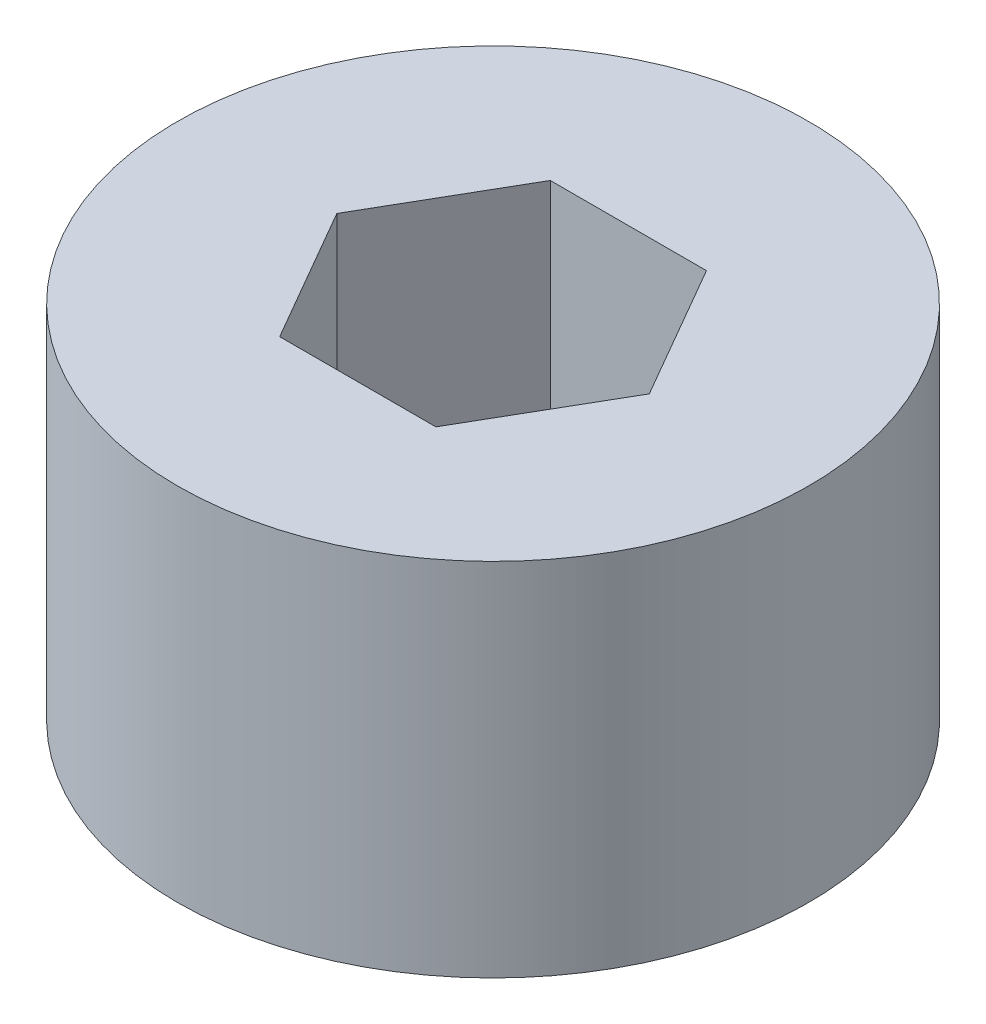
ISO-10303-21;
HEADER;
FILE_DESCRIPTION(('STEP AP214'),'2;1');
FILE_NAME('part.step','',(''),(''),'','','');
FILE_SCHEMA(('AUTOMOTIVE_DESIGN { 1 0 10303 214 1 1 1 1 }'));
ENDSEC;
DATA;
#1=APPLICATION_CONTEXT('core data for automotive mechanical design processes');
#2=APPLICATION_PROTOCOL_DEFINITION('international standard','automotive_design',2000,#1);
#3=PRODUCT_CONTEXT('',#1,'mechanical');
#4=PRODUCT('Part','Part','',(#3));
#5=PRODUCT_RELATED_PRODUCT_CATEGORY('part','',(#4));
#6=PRODUCT_DEFINITION_FORMATION('','',#4);
#7=PRODUCT_DEFINITION_CONTEXT('part definition',#1,'design');
#8=PRODUCT_DEFINITION('design','',#6,#7);
#9=PRODUCT_DEFINITION_SHAPE('','',#8);
#10=(LENGTH_UNIT() NAMED_UNIT(*) SI_UNIT(.MILLI.,.METRE.));
#11=(NAMED_UNIT(*) PLANE_ANGLE_UNIT() SI_UNIT($,.RADIAN.));
#12=(NAMED_UNIT(*) SI_UNIT($,.STERADIAN.) SOLID_ANGLE_UNIT());
#13=UNCERTAINTY_MEASURE_WITH_UNIT(LENGTH_MEASURE(1.E-05),#10,'distance_accuracy_value','');
#14=(GEOMETRIC_REPRESENTATION_CONTEXT(3) GLOBAL_UNCERTAINTY_ASSIGNED_CONTEXT((#13)) GLOBAL_UNIT_ASSIGNED_CONTEXT((#10,
#11,#12)) REPRESENTATION_CONTEXT('',''));
#15=CARTESIAN_POINT('',(0.,0.,0.));
#16=DIRECTION('',(0.,0.,1.));
#17=DIRECTION('',(1.,0.,0.));
#18=AXIS2_PLACEMENT_3D('',#15,#16,#17);
#19=CARTESIAN_POINT('',(0.,4.,0.));
#20=DIRECTION('',(0.,-1.,0.));
#21=DIRECTION('',(0.,0.,-1.));
#22=AXIS2_PLACEMENT_3D('',#19,#20,#21);
#23=CYLINDRICAL_SURFACE('',#22,3.5);
#24=CARTESIAN_POINT('',(0.,4.,0.));
#25=DIRECTION('',(0.,1.,0.));
#26=DIRECTION('',(0.,0.,1.));
#27=AXIS2_PLACEMENT_3D('',#24,#25,#26);
#28=CIRCLE('',#27,3.5);
#29=CARTESIAN_POINT('',(0.,4.,3.5));
#30=VERTEX_POINT('',#29);
#31=EDGE_CURVE('E43',#30,#30,#28,.T.);
#32=ORIENTED_EDGE('',*,*,#31,.F.);
#33=EDGE_LOOP('',(#32));
#34=FACE_BOUND('',#33,.T.);
#35=CARTESIAN_POINT('',(0.,0.,0.));
#36=DIRECTION('',(0.,1.,0.));
#37=DIRECTION('',(0.,0.,1.));
#38=AXIS2_PLACEMENT_3D('',#35,#36,#37);
#39=CIRCLE('',#38,3.5);
#40=CARTESIAN_POINT('',(0.,0.,3.5));
#41=VERTEX_POINT('',#40);
#42=EDGE_CURVE('E38',#41,#41,#39,.T.);
#43=ORIENTED_EDGE('',*,*,#42,.T.);
#44=EDGE_LOOP('',(#43));
#45=FACE_BOUND('',#44,.T.);
#46=ADVANCED_FACE('F35',(#34,#45),#23,.T.);
#47=CARTESIAN_POINT('',(0.,4.,0.));
#48=DIRECTION('',(0.,1.,0.));
#49=DIRECTION('',(0.,0.,1.));
#50=AXIS2_PLACEMENT_3D('',#47,#48,#49);
#51=PLANE('',#50);
#52=DIRECTION('',(0.5,0.,-0.866025403784439));
#53=VECTOR('',#52,1.);
#54=CARTESIAN_POINT('',(0.866025403784438,4.,1.5));
#55=LINE('',#54,#53);
#56=CARTESIAN_POINT('',(0.866025403784438,4.,1.5));
#57=VERTEX_POINT('',#56);
#58=CARTESIAN_POINT('',(1.73205080756888,4.,0.));
#59=VERTEX_POINT('',#58);
#60=EDGE_CURVE('E51',#57,#59,#55,.T.);
#61=ORIENTED_EDGE('',*,*,#60,.F.);
#62=DIRECTION('',(1.,0.,0.));
#63=VECTOR('',#62,1.);
#64=CARTESIAN_POINT('',(-0.86602540378444,4.,1.5));
#65=LINE('',#64,#63);
#66=CARTESIAN_POINT('',(-0.86602540378444,4.,1.5));
#67=VERTEX_POINT('',#66);
#68=EDGE_CURVE('E134',#67,#57,#65,.T.);
#69=ORIENTED_EDGE('',*,*,#68,.F.);
#70=DIRECTION('',(0.5,0.,0.866025403784439));
#71=VECTOR('',#70,1.);
#72=CARTESIAN_POINT('',(-1.73205080756888,4.,0.));
#73=LINE('',#72,#71);
#74=CARTESIAN_POINT('',(-1.73205080756888,4.,0.));
#75=VERTEX_POINT('',#74);
#76=EDGE_CURVE('E132',#75,#67,#73,.T.);
#77=ORIENTED_EDGE('',*,*,#76,.F.);
#78=DIRECTION('',(-0.5,0.,0.866025403784439));
#79=VECTOR('',#78,1.);
#80=CARTESIAN_POINT('',(-0.86602540378444,4.,-1.5));
#81=LINE('',#80,#79);
#82=CARTESIAN_POINT('',(-0.86602540378444,4.,-1.5));
#83=VERTEX_POINT('',#82);
#84=EDGE_CURVE('E99',#83,#75,#81,.T.);
#85=ORIENTED_EDGE('',*,*,#84,.F.);
#86=DIRECTION('',(-1.,0.,0.));
#87=VECTOR('',#86,1.);
#88=CARTESIAN_POINT('',(0.866025403784438,4.,-1.5));
#89=LINE('',#88,#87);
#90=CARTESIAN_POINT('',(0.866025403784438,4.,-1.5));
#91=VERTEX_POINT('',#90);
#92=EDGE_CURVE('E128',#91,#83,#89,.T.);
#93=ORIENTED_EDGE('',*,*,#92,.F.);
#94=DIRECTION('',(-0.5,0.,-0.866025403784438));
#95=VECTOR('',#94,1.);
#96=CARTESIAN_POINT('',(1.73205080756888,4.,0.));
#97=LINE('',#96,#95);
#98=EDGE_CURVE('E125',#59,#91,#97,.T.);
#99=ORIENTED_EDGE('',*,*,#98,.F.);
#100=EDGE_LOOP('',(#61,#69,#77,#85,#93,#99));
#101=FACE_BOUND('',#100,.T.);
#102=ORIENTED_EDGE('',*,*,#31,.T.);
#103=EDGE_LOOP('',(#102));
#104=FACE_BOUND('',#103,.T.);
#105=ADVANCED_FACE('F155',(#101,#104),#51,.T.);
#106=CARTESIAN_POINT('',(0.,0.,0.));
#107=DIRECTION('',(0.,1.,0.));
#108=DIRECTION('',(0.,0.,1.));
#109=AXIS2_PLACEMENT_3D('',#106,#107,#108);
#110=PLANE('',#109);
#111=CARTESIAN_POINT('',(0.,0.,0.));
#112=DIRECTION('',(0.,-1.,0.));
#113=DIRECTION('',(0.,0.,-1.));
#114=AXIS2_PLACEMENT_3D('',#111,#112,#113);
#115=CIRCLE('',#114,2.);
#116=CARTESIAN_POINT('',(0.,0.,-2.));
#117=VERTEX_POINT('',#116);
#118=EDGE_CURVE('E11',#117,#117,#115,.T.);
#119=ORIENTED_EDGE('',*,*,#118,.F.);
#120=EDGE_LOOP('',(#119));
#121=FACE_BOUND('',#120,.T.);
#122=ORIENTED_EDGE('',*,*,#42,.F.);
#123=EDGE_LOOP('',(#122));
#124=FACE_BOUND('',#123,.T.);
#125=ADVANCED_FACE('F152',(#121,#124),#110,.F.);
#126=CARTESIAN_POINT('',(0.,-1.,0.));
#127=DIRECTION('',(0.,1.,0.));
#128=DIRECTION('',(0.,0.,1.));
#129=AXIS2_PLACEMENT_3D('',#126,#127,#128);
#130=CYLINDRICAL_SURFACE('',#129,2.);
#131=CARTESIAN_POINT('',(0.,-1.,0.));
#132=DIRECTION('',(0.,-1.,0.));
#133=DIRECTION('',(0.,0.,-1.));
#134=AXIS2_PLACEMENT_3D('',#131,#132,#133);
#135=CIRCLE('',#134,2.);
#136=CARTESIAN_POINT('',(0.,-1.,-2.));
#137=VERTEX_POINT('',#136);
#138=EDGE_CURVE('E138',#137,#137,#135,.T.);
#139=ORIENTED_EDGE('',*,*,#138,.F.);
#140=EDGE_LOOP('',(#139));
#141=FACE_BOUND('',#140,.T.);
#142=ORIENTED_EDGE('',*,*,#118,.T.);
#143=EDGE_LOOP('',(#142));
#144=FACE_BOUND('',#143,.T.);
#145=ADVANCED_FACE('F154',(#141,#144),#130,.T.);
#146=CARTESIAN_POINT('',(0.,-1.,0.));
#147=DIRECTION('',(0.,-1.,0.));
#148=DIRECTION('',(0.,0.,-1.));
#149=AXIS2_PLACEMENT_3D('',#146,#147,#148);
#150=PLANE('',#149);
#151=ORIENTED_EDGE('',*,*,#138,.T.);
#152=EDGE_LOOP('',(#151));
#153=FACE_BOUND('',#152,.T.);
#154=ADVANCED_FACE('F161',(#153),#150,.T.);
#155=CARTESIAN_POINT('',(0.866025403784438,1.,1.5));
#156=DIRECTION('',(0.866025403784439,0.,0.5));
#157=DIRECTION('',(0.5,0.,-0.866025403784439));
#158=AXIS2_PLACEMENT_3D('',#155,#156,#157);
#159=PLANE('',#158);
#160=ORIENTED_EDGE('',*,*,#60,.T.);
#161=DIRECTION('',(0.,1.,0.));
#162=VECTOR('',#161,1.);
#163=CARTESIAN_POINT('',(1.73205080756888,1.,0.));
#164=LINE('',#163,#162);
#165=CARTESIAN_POINT('',(1.73205080756888,1.,0.));
#166=VERTEX_POINT('',#165);
#167=EDGE_CURVE('E81',#166,#59,#164,.T.);
#168=ORIENTED_EDGE('',*,*,#167,.F.);
#169=DIRECTION('',(0.5,0.,-0.866025403784439));
#170=VECTOR('',#169,1.);
#171=CARTESIAN_POINT('',(0.866025403784438,1.,1.5));
#172=LINE('',#171,#170);
#173=CARTESIAN_POINT('',(0.866025403784438,1.,1.5));
#174=VERTEX_POINT('',#173);
#175=EDGE_CURVE('E136',#174,#166,#172,.T.);
#176=ORIENTED_EDGE('',*,*,#175,.F.);
#177=DIRECTION('',(0.,1.,0.));
#178=VECTOR('',#177,1.);
#179=CARTESIAN_POINT('',(0.866025403784438,1.,1.5));
#180=LINE('',#179,#178);
#181=EDGE_CURVE('E59',#174,#57,#180,.T.);
#182=ORIENTED_EDGE('',*,*,#181,.T.);
#183=EDGE_LOOP('',(#160,#168,#176,#182));
#184=FACE_BOUND('',#183,.T.);
#185=ADVANCED_FACE('F186',(#184),#159,.F.);
#186=CARTESIAN_POINT('',(-0.86602540378444,1.,1.5));
#187=DIRECTION('',(0.,0.,1.));
#188=DIRECTION('',(1.,0.,0.));
#189=AXIS2_PLACEMENT_3D('',#186,#187,#188);
#190=PLANE('',#189);
#191=ORIENTED_EDGE('',*,*,#68,.T.);
#192=ORIENTED_EDGE('',*,*,#181,.F.);
#193=DIRECTION('',(1.,0.,0.));
#194=VECTOR('',#193,1.);
#195=CARTESIAN_POINT('',(-0.86602540378444,1.,1.5));
#196=LINE('',#195,#194);
#197=CARTESIAN_POINT('',(-0.86602540378444,1.,1.5));
#198=VERTEX_POINT('',#197);
#199=EDGE_CURVE('E111',#198,#174,#196,.T.);
#200=ORIENTED_EDGE('',*,*,#199,.F.);
#201=DIRECTION('',(0.,1.,0.));
#202=VECTOR('',#201,1.);
#203=CARTESIAN_POINT('',(-0.86602540378444,1.,1.5));
#204=LINE('',#203,#202);
#205=EDGE_CURVE('E103',#198,#67,#204,.T.);
#206=ORIENTED_EDGE('',*,*,#205,.T.);
#207=EDGE_LOOP('',(#191,#192,#200,#206));
#208=FACE_BOUND('',#207,.T.);
#209=ADVANCED_FACE('F191',(#208),#190,.F.);
#210=CARTESIAN_POINT('',(-1.73205080756888,1.,0.));
#211=DIRECTION('',(-0.866025403784439,0.,0.5));
#212=DIRECTION('',(0.5,0.,0.866025403784439));
#213=AXIS2_PLACEMENT_3D('',#210,#211,#212);
#214=PLANE('',#213);
#215=ORIENTED_EDGE('',*,*,#76,.T.);
#216=ORIENTED_EDGE('',*,*,#205,.F.);
#217=DIRECTION('',(0.5,0.,0.866025403784439));
#218=VECTOR('',#217,1.);
#219=CARTESIAN_POINT('',(-1.73205080756888,1.,0.));
#220=LINE('',#219,#218);
#221=CARTESIAN_POINT('',(-1.73205080756888,1.,0.));
#222=VERTEX_POINT('',#221);
#223=EDGE_CURVE('E107',#222,#198,#220,.T.);
#224=ORIENTED_EDGE('',*,*,#223,.F.);
#225=DIRECTION('',(0.,1.,0.));
#226=VECTOR('',#225,1.);
#227=CARTESIAN_POINT('',(-1.73205080756888,1.,0.));
#228=LINE('',#227,#226);
#229=EDGE_CURVE('E92',#222,#75,#228,.T.);
#230=ORIENTED_EDGE('',*,*,#229,.T.);
#231=EDGE_LOOP('',(#215,#216,#224,#230));
#232=FACE_BOUND('',#231,.T.);
#233=ADVANCED_FACE('F108',(#232),#214,.F.);
#234=CARTESIAN_POINT('',(-0.86602540378444,1.,-1.5));
#235=DIRECTION('',(-0.866025403784439,0.,-0.5));
#236=DIRECTION('',(-0.5,0.,0.866025403784439));
#237=AXIS2_PLACEMENT_3D('',#234,#235,#236);
#238=PLANE('',#237);
#239=ORIENTED_EDGE('',*,*,#84,.T.);
#240=ORIENTED_EDGE('',*,*,#229,.F.);
#241=DIRECTION('',(-0.5,0.,0.866025403784439));
#242=VECTOR('',#241,1.);
#243=CARTESIAN_POINT('',(-0.86602540378444,1.,-1.5));
#244=LINE('',#243,#242);
#245=CARTESIAN_POINT('',(-0.86602540378444,1.,-1.5));
#246=VERTEX_POINT('',#245);
#247=EDGE_CURVE('E96',#246,#222,#244,.T.);
#248=ORIENTED_EDGE('',*,*,#247,.F.);
#249=DIRECTION('',(0.,1.,0.));
#250=VECTOR('',#249,1.);
#251=CARTESIAN_POINT('',(-0.86602540378444,1.,-1.5));
#252=LINE('',#251,#250);
#253=EDGE_CURVE('E104',#246,#83,#252,.T.);
#254=ORIENTED_EDGE('',*,*,#253,.T.);
#255=EDGE_LOOP('',(#239,#240,#248,#254));
#256=FACE_BOUND('',#255,.T.);
#257=ADVANCED_FACE('F94',(#256),#238,.F.);
#258=CARTESIAN_POINT('',(0.866025403784438,1.,-1.5));
#259=DIRECTION('',(0.,0.,-1.));
#260=DIRECTION('',(-1.,0.,0.));
#261=AXIS2_PLACEMENT_3D('',#258,#259,#260);
#262=PLANE('',#261);
#263=ORIENTED_EDGE('',*,*,#92,.T.);
#264=ORIENTED_EDGE('',*,*,#253,.F.);
#265=DIRECTION('',(-1.,0.,0.));
#266=VECTOR('',#265,1.);
#267=CARTESIAN_POINT('',(0.866025403784438,1.,-1.5));
#268=LINE('',#267,#266);
#269=CARTESIAN_POINT('',(0.866025403784438,1.,-1.5));
#270=VERTEX_POINT('',#269);
#271=EDGE_CURVE('E117',#270,#246,#268,.T.);
#272=ORIENTED_EDGE('',*,*,#271,.F.);
#273=DIRECTION('',(0.,1.,0.));
#274=VECTOR('',#273,1.);
#275=CARTESIAN_POINT('',(0.866025403784438,1.,-1.5));
#276=LINE('',#275,#274);
#277=EDGE_CURVE('E141',#270,#91,#276,.T.);
#278=ORIENTED_EDGE('',*,*,#277,.T.);
#279=EDGE_LOOP('',(#263,#264,#272,#278));
#280=FACE_BOUND('',#279,.T.);
#281=ADVANCED_FACE('F216',(#280),#262,.F.);
#282=CARTESIAN_POINT('',(1.73205080756888,1.,0.));
#283=DIRECTION('',(0.866025403784439,0.,-0.5));
#284=DIRECTION('',(-0.5,0.,-0.866025403784439));
#285=AXIS2_PLACEMENT_3D('',#282,#283,#284);
#286=PLANE('',#285);
#287=ORIENTED_EDGE('',*,*,#98,.T.);
#288=ORIENTED_EDGE('',*,*,#277,.F.);
#289=DIRECTION('',(-0.5,0.,-0.866025403784438));
#290=VECTOR('',#289,1.);
#291=CARTESIAN_POINT('',(1.73205080756888,1.,0.));
#292=LINE('',#291,#290);
#293=EDGE_CURVE('E119',#166,#270,#292,.T.);
#294=ORIENTED_EDGE('',*,*,#293,.F.);
#295=ORIENTED_EDGE('',*,*,#167,.T.);
#296=EDGE_LOOP('',(#287,#288,#294,#295));
#297=FACE_BOUND('',#296,.T.);
#298=ADVANCED_FACE('F225',(#297),#286,.F.);
#299=CARTESIAN_POINT('',(0.,1.,0.));
#300=DIRECTION('',(0.,1.,0.));
#301=DIRECTION('',(0.,0.,1.));
#302=AXIS2_PLACEMENT_3D('',#299,#300,#301);
#303=PLANE('',#302);
#304=ORIENTED_EDGE('',*,*,#175,.T.);
#305=ORIENTED_EDGE('',*,*,#293,.T.);
#306=ORIENTED_EDGE('',*,*,#271,.T.);
#307=ORIENTED_EDGE('',*,*,#247,.T.);
#308=ORIENTED_EDGE('',*,*,#223,.T.);
#309=ORIENTED_EDGE('',*,*,#199,.T.);
#310=EDGE_LOOP('',(#304,#305,#306,#307,#308,#309));
#311=FACE_BOUND('',#310,.T.);
#312=ADVANCED_FACE('F114',(#311),#303,.T.);
#313=CLOSED_SHELL('',(#46,#105,#125,#145,#154,#185,#209,#233,#257,#281,#298,#312));
#314=MANIFOLD_SOLID_BREP('B2',#313);
#315=ADVANCED_BREP_SHAPE_REPRESENTATION('',(#18,#314),#14);
#316=SHAPE_DEFINITION_REPRESENTATION(#9,#315);
ENDSEC;
END-ISO-10303-21;
